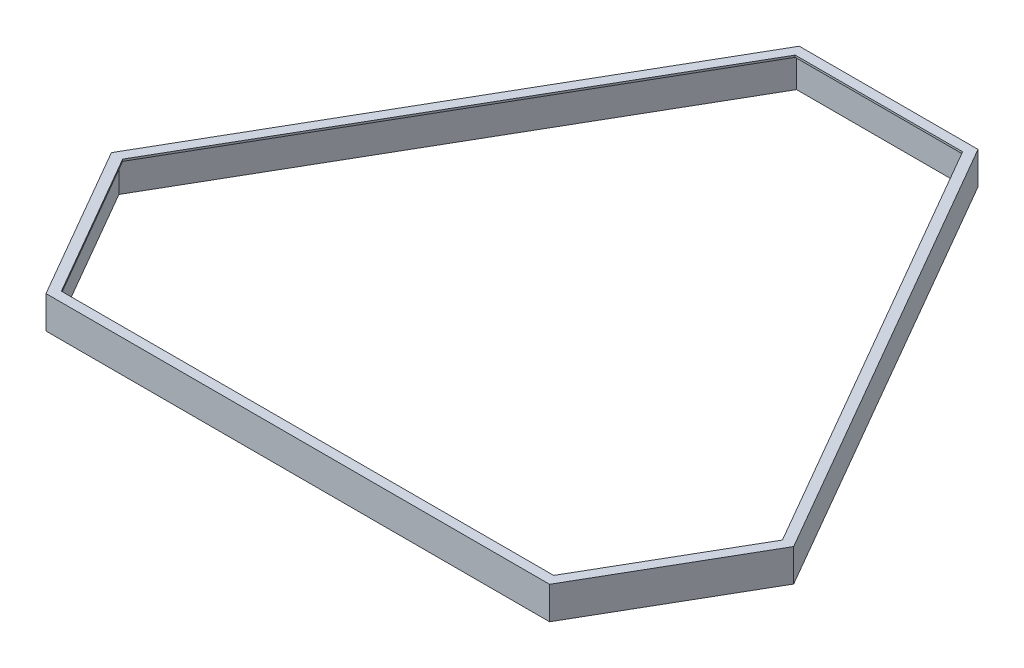
ISO-10303-21;
HEADER;
FILE_DESCRIPTION(('STEP AP214'),'2;1');
FILE_NAME('part.step','',(''),(''),'','','');
FILE_SCHEMA(('AUTOMOTIVE_DESIGN { 1 0 10303 214 1 1 1 1 }'));
ENDSEC;
DATA;
#1=APPLICATION_CONTEXT('core data for automotive mechanical design processes');
#2=APPLICATION_PROTOCOL_DEFINITION('international standard','automotive_design',2000,#1);
#3=PRODUCT_CONTEXT('',#1,'mechanical');
#4=PRODUCT('Part','Part','',(#3));
#5=PRODUCT_RELATED_PRODUCT_CATEGORY('part','',(#4));
#6=PRODUCT_DEFINITION_FORMATION('','',#4);
#7=PRODUCT_DEFINITION_CONTEXT('part definition',#1,'design');
#8=PRODUCT_DEFINITION('design','',#6,#7);
#9=PRODUCT_DEFINITION_SHAPE('','',#8);
#10=(LENGTH_UNIT() NAMED_UNIT(*) SI_UNIT(.MILLI.,.METRE.));
#11=(NAMED_UNIT(*) PLANE_ANGLE_UNIT() SI_UNIT($,.RADIAN.));
#12=(NAMED_UNIT(*) SI_UNIT($,.STERADIAN.) SOLID_ANGLE_UNIT());
#13=UNCERTAINTY_MEASURE_WITH_UNIT(LENGTH_MEASURE(1.E-05),#10,'distance_accuracy_value','');
#14=(GEOMETRIC_REPRESENTATION_CONTEXT(3) GLOBAL_UNCERTAINTY_ASSIGNED_CONTEXT((#13)) GLOBAL_UNIT_ASSIGNED_CONTEXT((#10,
#11,#12)) REPRESENTATION_CONTEXT('',''));
#15=CARTESIAN_POINT('',(0.,0.,0.));
#16=DIRECTION('',(0.,0.,1.));
#17=DIRECTION('',(1.,0.,0.));
#18=AXIS2_PLACEMENT_3D('',#15,#16,#17);
#19=CARTESIAN_POINT('',(-64.5179491924311,10.,-37.2494553338127));
#20=DIRECTION('',(-0.866025403784439,0.,-0.5));
#21=DIRECTION('',(-0.5,0.,0.866025403784439));
#22=AXIS2_PLACEMENT_3D('',#19,#20,#21);
#23=PLANE('',#22);
#24=DIRECTION('',(0.5,0.,-0.866025403784439));
#25=VECTOR('',#24,1.);
#26=CARTESIAN_POINT('',(-64.5179491924311,9.4,-37.2494553338127));
#27=LINE('',#26,#25);
#28=CARTESIAN_POINT('',(-102.690598923242,9.4,28.8675134594814));
#29=VERTEX_POINT('',#28);
#30=CARTESIAN_POINT('',(-26.3452994616208,9.4,-103.366424127107));
#31=VERTEX_POINT('',#30);
#32=EDGE_CURVE('E91',#29,#31,#27,.T.);
#33=ORIENTED_EDGE('',*,*,#32,.F.);
#34=DIRECTION('',(0.,-1.,0.));
#35=VECTOR('',#34,1.);
#36=CARTESIAN_POINT('',(-102.690598923242,10.,28.8675134594814));
#37=LINE('',#36,#35);
#38=CARTESIAN_POINT('',(-102.690598923242,0.,28.8675134594814));
#39=VERTEX_POINT('',#38);
#40=EDGE_CURVE('E320',#29,#39,#37,.T.);
#41=ORIENTED_EDGE('',*,*,#40,.T.);
#42=DIRECTION('',(0.5,0.,-0.866025403784439));
#43=VECTOR('',#42,1.);
#44=CARTESIAN_POINT('',(-64.5179491924311,0.,-37.2494553338127));
#45=LINE('',#44,#43);
#46=CARTESIAN_POINT('',(-26.3452994616208,0.,-103.366424127107));
#47=VERTEX_POINT('',#46);
#48=EDGE_CURVE('E295',#39,#47,#45,.T.);
#49=ORIENTED_EDGE('',*,*,#48,.T.);
#50=DIRECTION('',(0.,-1.,0.));
#51=VECTOR('',#50,1.);
#52=CARTESIAN_POINT('',(-26.3452994616208,10.,-103.366424127107));
#53=LINE('',#52,#51);
#54=EDGE_CURVE('E319',#31,#47,#53,.T.);
#55=ORIENTED_EDGE('',*,*,#54,.F.);
#56=EDGE_LOOP('',(#33,#41,#49,#55));
#57=FACE_BOUND('',#56,.T.);
#58=ADVANCED_FACE('F75',(#57),#23,.F.);
#59=CARTESIAN_POINT('',(-89.5179491924312,10.,51.6832120635534));
#60=DIRECTION('',(-0.866025403784439,0.,0.5));
#61=DIRECTION('',(0.5,0.,0.866025403784439));
#62=AXIS2_PLACEMENT_3D('',#59,#60,#61);
#63=PLANE('',#62);
#64=DIRECTION('',(-0.5,0.,-0.866025403784439));
#65=VECTOR('',#64,1.);
#66=CARTESIAN_POINT('',(-89.5179491924312,9.4,51.6832120635534));
#67=LINE('',#66,#65);
#68=CARTESIAN_POINT('',(-76.3452994616208,9.4,74.4989106676256));
#69=VERTEX_POINT('',#68);
#70=EDGE_CURVE('E98',#69,#29,#67,.T.);
#71=ORIENTED_EDGE('',*,*,#70,.F.);
#72=DIRECTION('',(0.,-1.,0.));
#73=VECTOR('',#72,1.);
#74=CARTESIAN_POINT('',(-76.3452994616208,10.,74.4989106676256));
#75=LINE('',#74,#73);
#76=CARTESIAN_POINT('',(-76.3452994616208,0.,74.4989106676256));
#77=VERTEX_POINT('',#76);
#78=EDGE_CURVE('E324',#69,#77,#75,.T.);
#79=ORIENTED_EDGE('',*,*,#78,.T.);
#80=DIRECTION('',(-0.5,0.,-0.866025403784439));
#81=VECTOR('',#80,1.);
#82=CARTESIAN_POINT('',(-89.5179491924312,0.,51.6832120635534));
#83=LINE('',#82,#81);
#84=EDGE_CURVE('E315',#77,#39,#83,.T.);
#85=ORIENTED_EDGE('',*,*,#84,.T.);
#86=ORIENTED_EDGE('',*,*,#40,.F.);
#87=EDGE_LOOP('',(#71,#79,#85,#86));
#88=FACE_BOUND('',#87,.T.);
#89=ADVANCED_FACE('F437',(#88),#63,.F.);
#90=CARTESIAN_POINT('',(0.,10.,74.4989106676256));
#91=DIRECTION('',(0.,0.,1.));
#92=DIRECTION('',(1.,0.,0.));
#93=AXIS2_PLACEMENT_3D('',#90,#91,#92);
#94=PLANE('',#93);
#95=DIRECTION('',(-1.,0.,0.));
#96=VECTOR('',#95,1.);
#97=CARTESIAN_POINT('',(0.,9.4,74.4989106676256));
#98=LINE('',#97,#96);
#99=CARTESIAN_POINT('',(76.3452994616207,9.4,74.4989106676256));
#100=VERTEX_POINT('',#99);
#101=EDGE_CURVE('E287',#100,#69,#98,.T.);
#102=ORIENTED_EDGE('',*,*,#101,.F.);
#103=DIRECTION('',(0.,-1.,0.));
#104=VECTOR('',#103,1.);
#105=CARTESIAN_POINT('',(76.3452994616207,10.,74.4989106676256));
#106=LINE('',#105,#104);
#107=CARTESIAN_POINT('',(76.3452994616207,0.,74.4989106676256));
#108=VERTEX_POINT('',#107);
#109=EDGE_CURVE('E327',#100,#108,#106,.T.);
#110=ORIENTED_EDGE('',*,*,#109,.T.);
#111=DIRECTION('',(-1.,0.,0.));
#112=VECTOR('',#111,1.);
#113=CARTESIAN_POINT('',(0.,0.,74.4989106676256));
#114=LINE('',#113,#112);
#115=EDGE_CURVE('E311',#108,#77,#114,.T.);
#116=ORIENTED_EDGE('',*,*,#115,.T.);
#117=ORIENTED_EDGE('',*,*,#78,.F.);
#118=EDGE_LOOP('',(#102,#110,#116,#117));
#119=FACE_BOUND('',#118,.T.);
#120=ADVANCED_FACE('F442',(#119),#94,.F.);
#121=CARTESIAN_POINT('',(89.5179491924312,10.,51.6832120635534));
#122=DIRECTION('',(0.866025403784439,0.,0.5));
#123=DIRECTION('',(0.5,0.,-0.866025403784439));
#124=AXIS2_PLACEMENT_3D('',#121,#122,#123);
#125=PLANE('',#124);
#126=DIRECTION('',(-0.5,0.,0.866025403784439));
#127=VECTOR('',#126,1.);
#128=CARTESIAN_POINT('',(89.5179491924312,9.4,51.6832120635534));
#129=LINE('',#128,#127);
#130=CARTESIAN_POINT('',(102.690598923241,9.4,28.8675134594814));
#131=VERTEX_POINT('',#130);
#132=EDGE_CURVE('E283',#131,#100,#129,.T.);
#133=ORIENTED_EDGE('',*,*,#132,.F.);
#134=DIRECTION('',(0.,-1.,0.));
#135=VECTOR('',#134,1.);
#136=CARTESIAN_POINT('',(102.690598923241,10.,28.8675134594814));
#137=LINE('',#136,#135);
#138=CARTESIAN_POINT('',(102.690598923241,0.,28.8675134594814));
#139=VERTEX_POINT('',#138);
#140=EDGE_CURVE('E330',#131,#139,#137,.T.);
#141=ORIENTED_EDGE('',*,*,#140,.T.);
#142=DIRECTION('',(-0.5,0.,0.866025403784439));
#143=VECTOR('',#142,1.);
#144=CARTESIAN_POINT('',(89.5179491924312,0.,51.6832120635534));
#145=LINE('',#144,#143);
#146=EDGE_CURVE('E307',#139,#108,#145,.T.);
#147=ORIENTED_EDGE('',*,*,#146,.T.);
#148=ORIENTED_EDGE('',*,*,#109,.F.);
#149=EDGE_LOOP('',(#133,#141,#147,#148));
#150=FACE_BOUND('',#149,.T.);
#151=ADVANCED_FACE('F465',(#150),#125,.F.);
#152=CARTESIAN_POINT('',(64.5179491924311,10.,-37.2494553338127));
#153=DIRECTION('',(0.866025403784439,0.,-0.5));
#154=DIRECTION('',(-0.5,0.,-0.866025403784439));
#155=AXIS2_PLACEMENT_3D('',#152,#153,#154);
#156=PLANE('',#155);
#157=DIRECTION('',(0.5,0.,0.866025403784439));
#158=VECTOR('',#157,1.);
#159=CARTESIAN_POINT('',(64.5179491924311,9.4,-37.2494553338127));
#160=LINE('',#159,#158);
#161=CARTESIAN_POINT('',(26.3452994616207,9.4,-103.366424127107));
#162=VERTEX_POINT('',#161);
#163=EDGE_CURVE('E268',#162,#131,#160,.T.);
#164=ORIENTED_EDGE('',*,*,#163,.F.);
#165=DIRECTION('',(0.,-1.,0.));
#166=VECTOR('',#165,1.);
#167=CARTESIAN_POINT('',(26.3452994616207,10.,-103.366424127107));
#168=LINE('',#167,#166);
#169=CARTESIAN_POINT('',(26.3452994616207,0.,-103.366424127107));
#170=VERTEX_POINT('',#169);
#171=EDGE_CURVE('E333',#162,#170,#168,.T.);
#172=ORIENTED_EDGE('',*,*,#171,.T.);
#173=DIRECTION('',(0.5,0.,0.866025403784439));
#174=VECTOR('',#173,1.);
#175=CARTESIAN_POINT('',(64.5179491924311,0.,-37.2494553338127));
#176=LINE('',#175,#174);
#177=EDGE_CURVE('E303',#170,#139,#176,.T.);
#178=ORIENTED_EDGE('',*,*,#177,.T.);
#179=ORIENTED_EDGE('',*,*,#140,.F.);
#180=EDGE_LOOP('',(#164,#172,#178,#179));
#181=FACE_BOUND('',#180,.T.);
#182=ADVANCED_FACE('F469',(#181),#156,.F.);
#183=CARTESIAN_POINT('',(0.,10.,-103.366424127107));
#184=DIRECTION('',(0.,0.,-1.));
#185=DIRECTION('',(-1.,0.,0.));
#186=AXIS2_PLACEMENT_3D('',#183,#184,#185);
#187=PLANE('',#186);
#188=DIRECTION('',(1.,0.,0.));
#189=VECTOR('',#188,1.);
#190=CARTESIAN_POINT('',(0.,9.4,-103.366424127107));
#191=LINE('',#190,#189);
#192=EDGE_CURVE('E12',#31,#162,#191,.T.);
#193=ORIENTED_EDGE('',*,*,#192,.F.);
#194=ORIENTED_EDGE('',*,*,#54,.T.);
#195=DIRECTION('',(1.,0.,0.));
#196=VECTOR('',#195,1.);
#197=CARTESIAN_POINT('',(0.,0.,-103.366424127107));
#198=LINE('',#197,#196);
#199=EDGE_CURVE('E299',#47,#170,#198,.T.);
#200=ORIENTED_EDGE('',*,*,#199,.T.);
#201=ORIENTED_EDGE('',*,*,#171,.F.);
#202=EDGE_LOOP('',(#193,#194,#200,#201));
#203=FACE_BOUND('',#202,.T.);
#204=ADVANCED_FACE('F446',(#203),#187,.F.);
#205=CARTESIAN_POINT('',(-105.,10.,28.8675134594814));
#206=DIRECTION('',(-0.866025403784439,0.,-0.5));
#207=DIRECTION('',(-0.5,0.,0.866025403784439));
#208=AXIS2_PLACEMENT_3D('',#205,#206,#207);
#209=PLANE('',#208);
#210=DIRECTION('',(0.,-1.,0.));
#211=VECTOR('',#210,1.);
#212=CARTESIAN_POINT('',(-27.5,10.,-105.366424127107));
#213=LINE('',#212,#211);
#214=CARTESIAN_POINT('',(-27.5,10.,-105.366424127107));
#215=VERTEX_POINT('',#214);
#216=CARTESIAN_POINT('',(-27.5,0.,-105.366424127107));
#217=VERTEX_POINT('',#216);
#218=EDGE_CURVE('E363',#215,#217,#213,.T.);
#219=ORIENTED_EDGE('',*,*,#218,.T.);
#220=DIRECTION('',(0.5,0.,-0.866025403784439));
#221=VECTOR('',#220,1.);
#222=CARTESIAN_POINT('',(-105.,0.,28.8675134594814));
#223=LINE('',#222,#221);
#224=CARTESIAN_POINT('',(-105.,0.,28.8675134594814));
#225=VERTEX_POINT('',#224);
#226=EDGE_CURVE('E323',#225,#217,#223,.T.);
#227=ORIENTED_EDGE('',*,*,#226,.F.);
#228=DIRECTION('',(0.,-1.,0.));
#229=VECTOR('',#228,1.);
#230=CARTESIAN_POINT('',(-105.,10.,28.8675134594814));
#231=LINE('',#230,#229);
#232=CARTESIAN_POINT('',(-105.,10.,28.8675134594814));
#233=VERTEX_POINT('',#232);
#234=EDGE_CURVE('E84',#233,#225,#231,.T.);
#235=ORIENTED_EDGE('',*,*,#234,.F.);
#236=DIRECTION('',(0.5,0.,-0.866025403784439));
#237=VECTOR('',#236,1.);
#238=CARTESIAN_POINT('',(-105.,10.,28.8675134594814));
#239=LINE('',#238,#237);
#240=EDGE_CURVE('E338',#233,#215,#239,.T.);
#241=ORIENTED_EDGE('',*,*,#240,.T.);
#242=EDGE_LOOP('',(#219,#227,#235,#241));
#243=FACE_BOUND('',#242,.T.);
#244=ADVANCED_FACE('F77',(#243),#209,.T.);
#245=CARTESIAN_POINT('',(-77.5,10.,76.4989106676256));
#246=DIRECTION('',(-0.866025403784439,0.,0.5));
#247=DIRECTION('',(0.5,0.,0.866025403784439));
#248=AXIS2_PLACEMENT_3D('',#245,#246,#247);
#249=PLANE('',#248);
#250=ORIENTED_EDGE('',*,*,#234,.T.);
#251=DIRECTION('',(-0.5,0.,-0.866025403784438));
#252=VECTOR('',#251,1.);
#253=CARTESIAN_POINT('',(-77.5,0.,76.4989106676256));
#254=LINE('',#253,#252);
#255=CARTESIAN_POINT('',(-77.5,0.,76.4989106676256));
#256=VERTEX_POINT('',#255);
#257=EDGE_CURVE('E343',#256,#225,#254,.T.);
#258=ORIENTED_EDGE('',*,*,#257,.F.);
#259=DIRECTION('',(0.,-1.,0.));
#260=VECTOR('',#259,1.);
#261=CARTESIAN_POINT('',(-77.5,10.,76.4989106676256));
#262=LINE('',#261,#260);
#263=CARTESIAN_POINT('',(-77.5,10.,76.4989106676256));
#264=VERTEX_POINT('',#263);
#265=EDGE_CURVE('E388',#264,#256,#262,.T.);
#266=ORIENTED_EDGE('',*,*,#265,.F.);
#267=DIRECTION('',(-0.5,0.,-0.866025403784438));
#268=VECTOR('',#267,1.);
#269=CARTESIAN_POINT('',(-77.5,10.,76.4989106676256));
#270=LINE('',#269,#268);
#271=EDGE_CURVE('E359',#264,#233,#270,.T.);
#272=ORIENTED_EDGE('',*,*,#271,.T.);
#273=EDGE_LOOP('',(#250,#258,#266,#272));
#274=FACE_BOUND('',#273,.T.);
#275=ADVANCED_FACE('F413',(#274),#249,.T.);
#276=CARTESIAN_POINT('',(77.5,10.,76.4989106676256));
#277=DIRECTION('',(0.,0.,1.));
#278=DIRECTION('',(1.,0.,0.));
#279=AXIS2_PLACEMENT_3D('',#276,#277,#278);
#280=PLANE('',#279);
#281=ORIENTED_EDGE('',*,*,#265,.T.);
#282=DIRECTION('',(-1.,0.,0.));
#283=VECTOR('',#282,1.);
#284=CARTESIAN_POINT('',(77.5,0.,76.4989106676256));
#285=LINE('',#284,#283);
#286=CARTESIAN_POINT('',(77.5,0.,76.4989106676256));
#287=VERTEX_POINT('',#286);
#288=EDGE_CURVE('E379',#287,#256,#285,.T.);
#289=ORIENTED_EDGE('',*,*,#288,.F.);
#290=DIRECTION('',(0.,-1.,0.));
#291=VECTOR('',#290,1.);
#292=CARTESIAN_POINT('',(77.5,10.,76.4989106676256));
#293=LINE('',#292,#291);
#294=CARTESIAN_POINT('',(77.5,10.,76.4989106676256));
#295=VERTEX_POINT('',#294);
#296=EDGE_CURVE('E391',#295,#287,#293,.T.);
#297=ORIENTED_EDGE('',*,*,#296,.F.);
#298=DIRECTION('',(-1.,0.,0.));
#299=VECTOR('',#298,1.);
#300=CARTESIAN_POINT('',(77.5,10.,76.4989106676256));
#301=LINE('',#300,#299);
#302=EDGE_CURVE('E355',#295,#264,#301,.T.);
#303=ORIENTED_EDGE('',*,*,#302,.T.);
#304=EDGE_LOOP('',(#281,#289,#297,#303));
#305=FACE_BOUND('',#304,.T.);
#306=ADVANCED_FACE('F427',(#305),#280,.T.);
#307=CARTESIAN_POINT('',(105.,10.,28.8675134594814));
#308=DIRECTION('',(0.866025403784439,0.,0.5));
#309=DIRECTION('',(0.5,0.,-0.866025403784439));
#310=AXIS2_PLACEMENT_3D('',#307,#308,#309);
#311=PLANE('',#310);
#312=ORIENTED_EDGE('',*,*,#296,.T.);
#313=DIRECTION('',(-0.5,0.,0.866025403784439));
#314=VECTOR('',#313,1.);
#315=CARTESIAN_POINT('',(105.,0.,28.8675134594814));
#316=LINE('',#315,#314);
#317=CARTESIAN_POINT('',(105.,0.,28.8675134594814));
#318=VERTEX_POINT('',#317);
#319=EDGE_CURVE('E375',#318,#287,#316,.T.);
#320=ORIENTED_EDGE('',*,*,#319,.F.);
#321=DIRECTION('',(0.,-1.,0.));
#322=VECTOR('',#321,1.);
#323=CARTESIAN_POINT('',(105.,10.,28.8675134594814));
#324=LINE('',#323,#322);
#325=CARTESIAN_POINT('',(105.,10.,28.8675134594814));
#326=VERTEX_POINT('',#325);
#327=EDGE_CURVE('E394',#326,#318,#324,.T.);
#328=ORIENTED_EDGE('',*,*,#327,.F.);
#329=DIRECTION('',(-0.5,0.,0.866025403784439));
#330=VECTOR('',#329,1.);
#331=CARTESIAN_POINT('',(105.,10.,28.8675134594814));
#332=LINE('',#331,#330);
#333=EDGE_CURVE('E351',#326,#295,#332,.T.);
#334=ORIENTED_EDGE('',*,*,#333,.T.);
#335=EDGE_LOOP('',(#312,#320,#328,#334));
#336=FACE_BOUND('',#335,.T.);
#337=ADVANCED_FACE('F425',(#336),#311,.T.);
#338=CARTESIAN_POINT('',(27.5,10.,-105.366424127107));
#339=DIRECTION('',(0.866025403784439,0.,-0.5));
#340=DIRECTION('',(-0.5,0.,-0.866025403784439));
#341=AXIS2_PLACEMENT_3D('',#338,#339,#340);
#342=PLANE('',#341);
#343=ORIENTED_EDGE('',*,*,#327,.T.);
#344=DIRECTION('',(0.5,0.,0.866025403784439));
#345=VECTOR('',#344,1.);
#346=CARTESIAN_POINT('',(27.5,0.,-105.366424127107));
#347=LINE('',#346,#345);
#348=CARTESIAN_POINT('',(27.5,0.,-105.366424127107));
#349=VERTEX_POINT('',#348);
#350=EDGE_CURVE('E371',#349,#318,#347,.T.);
#351=ORIENTED_EDGE('',*,*,#350,.F.);
#352=DIRECTION('',(0.,-1.,0.));
#353=VECTOR('',#352,1.);
#354=CARTESIAN_POINT('',(27.5,10.,-105.366424127107));
#355=LINE('',#354,#353);
#356=CARTESIAN_POINT('',(27.5,10.,-105.366424127107));
#357=VERTEX_POINT('',#356);
#358=EDGE_CURVE('E397',#357,#349,#355,.T.);
#359=ORIENTED_EDGE('',*,*,#358,.F.);
#360=DIRECTION('',(0.5,0.,0.866025403784439));
#361=VECTOR('',#360,1.);
#362=CARTESIAN_POINT('',(27.5,10.,-105.366424127107));
#363=LINE('',#362,#361);
#364=EDGE_CURVE('E347',#357,#326,#363,.T.);
#365=ORIENTED_EDGE('',*,*,#364,.T.);
#366=EDGE_LOOP('',(#343,#351,#359,#365));
#367=FACE_BOUND('',#366,.T.);
#368=ADVANCED_FACE('F422',(#367),#342,.T.);
#369=CARTESIAN_POINT('',(-27.5,10.,-105.366424127107));
#370=DIRECTION('',(0.,0.,-1.));
#371=DIRECTION('',(-1.,0.,0.));
#372=AXIS2_PLACEMENT_3D('',#369,#370,#371);
#373=PLANE('',#372);
#374=ORIENTED_EDGE('',*,*,#358,.T.);
#375=DIRECTION('',(1.,0.,0.));
#376=VECTOR('',#375,1.);
#377=CARTESIAN_POINT('',(-27.5,0.,-105.366424127107));
#378=LINE('',#377,#376);
#379=EDGE_CURVE('E367',#217,#349,#378,.T.);
#380=ORIENTED_EDGE('',*,*,#379,.F.);
#381=ORIENTED_EDGE('',*,*,#218,.F.);
#382=DIRECTION('',(1.,0.,0.));
#383=VECTOR('',#382,1.);
#384=CARTESIAN_POINT('',(-27.5,10.,-105.366424127107));
#385=LINE('',#384,#383);
#386=EDGE_CURVE('E342',#215,#357,#385,.T.);
#387=ORIENTED_EDGE('',*,*,#386,.T.);
#388=EDGE_LOOP('',(#374,#380,#381,#387));
#389=FACE_BOUND('',#388,.T.);
#390=ADVANCED_FACE('F406',(#389),#373,.T.);
#391=CARTESIAN_POINT('',(0.,10.,0.));
#392=DIRECTION('',(0.,-1.,0.));
#393=DIRECTION('',(0.,0.,-1.));
#394=AXIS2_PLACEMENT_3D('',#391,#392,#393);
#395=PLANE('',#394);
#396=ORIENTED_EDGE('',*,*,#240,.F.);
#397=ORIENTED_EDGE('',*,*,#271,.F.);
#398=ORIENTED_EDGE('',*,*,#302,.F.);
#399=ORIENTED_EDGE('',*,*,#333,.F.);
#400=ORIENTED_EDGE('',*,*,#364,.F.);
#401=ORIENTED_EDGE('',*,*,#386,.F.);
#402=EDGE_LOOP('',(#396,#397,#398,#399,#400,#401));
#403=FACE_BOUND('',#402,.T.);
#404=DIRECTION('',(-1.,0.,0.));
#405=VECTOR('',#404,1.);
#406=CARTESIAN_POINT('',(25.7679491924311,10.,-102.366424127107));
#407=LINE('',#406,#405);
#408=CARTESIAN_POINT('',(25.7679491924311,10.,-102.366424127107));
#409=VERTEX_POINT('',#408);
#410=CARTESIAN_POINT('',(-25.7679491924311,10.,-102.366424127107));
#411=VERTEX_POINT('',#410);
#412=EDGE_CURVE('E209',#409,#411,#407,.T.);
#413=ORIENTED_EDGE('',*,*,#412,.F.);
#414=DIRECTION('',(-0.5,0.,-0.866025403784439));
#415=VECTOR('',#414,1.);
#416=CARTESIAN_POINT('',(101.535898384862,10.,28.8675134594814));
#417=LINE('',#416,#415);
#418=CARTESIAN_POINT('',(101.535898384862,10.,28.8675134594814));
#419=VERTEX_POINT('',#418);
#420=EDGE_CURVE('E231',#419,#409,#417,.T.);
#421=ORIENTED_EDGE('',*,*,#420,.F.);
#422=DIRECTION('',(0.5,0.,-0.866025403784439));
#423=VECTOR('',#422,1.);
#424=CARTESIAN_POINT('',(75.7679491924311,10.,73.4989106676256));
#425=LINE('',#424,#423);
#426=CARTESIAN_POINT('',(75.7679491924311,10.,73.4989106676256));
#427=VERTEX_POINT('',#426);
#428=EDGE_CURVE('E235',#427,#419,#425,.T.);
#429=ORIENTED_EDGE('',*,*,#428,.F.);
#430=DIRECTION('',(1.,0.,0.));
#431=VECTOR('',#430,1.);
#432=CARTESIAN_POINT('',(-75.7679491924311,10.,73.4989106676256));
#433=LINE('',#432,#431);
#434=CARTESIAN_POINT('',(-75.7679491924311,10.,73.4989106676256));
#435=VERTEX_POINT('',#434);
#436=EDGE_CURVE('E258',#435,#427,#433,.T.);
#437=ORIENTED_EDGE('',*,*,#436,.F.);
#438=DIRECTION('',(0.5,0.,0.866025403784439));
#439=VECTOR('',#438,1.);
#440=CARTESIAN_POINT('',(-101.535898384862,10.,28.8675134594814));
#441=LINE('',#440,#439);
#442=CARTESIAN_POINT('',(-101.535898384862,10.,28.8675134594814));
#443=VERTEX_POINT('',#442);
#444=EDGE_CURVE('E254',#443,#435,#441,.T.);
#445=ORIENTED_EDGE('',*,*,#444,.F.);
#446=DIRECTION('',(-0.5,0.,0.866025403784439));
#447=VECTOR('',#446,1.);
#448=CARTESIAN_POINT('',(-25.7679491924311,10.,-102.366424127107));
#449=LINE('',#448,#447);
#450=EDGE_CURVE('E251',#411,#443,#449,.T.);
#451=ORIENTED_EDGE('',*,*,#450,.F.);
#452=EDGE_LOOP('',(#413,#421,#429,#437,#445,#451));
#453=FACE_BOUND('',#452,.T.);
#454=ADVANCED_FACE('F416',(#403,#453),#395,.F.);
#455=CARTESIAN_POINT('',(0.,0.,0.));
#456=DIRECTION('',(0.,-1.,0.));
#457=DIRECTION('',(0.,0.,-1.));
#458=AXIS2_PLACEMENT_3D('',#455,#456,#457);
#459=PLANE('',#458);
#460=ORIENTED_EDGE('',*,*,#48,.F.);
#461=ORIENTED_EDGE('',*,*,#84,.F.);
#462=ORIENTED_EDGE('',*,*,#115,.F.);
#463=ORIENTED_EDGE('',*,*,#146,.F.);
#464=ORIENTED_EDGE('',*,*,#177,.F.);
#465=ORIENTED_EDGE('',*,*,#199,.F.);
#466=EDGE_LOOP('',(#460,#461,#462,#463,#464,#465));
#467=FACE_BOUND('',#466,.T.);
#468=ORIENTED_EDGE('',*,*,#226,.T.);
#469=ORIENTED_EDGE('',*,*,#379,.T.);
#470=ORIENTED_EDGE('',*,*,#350,.T.);
#471=ORIENTED_EDGE('',*,*,#319,.T.);
#472=ORIENTED_EDGE('',*,*,#288,.T.);
#473=ORIENTED_EDGE('',*,*,#257,.T.);
#474=EDGE_LOOP('',(#468,#469,#470,#471,#472,#473));
#475=FACE_BOUND('',#474,.T.);
#476=ADVANCED_FACE('F409',(#467,#475),#459,.T.);
#477=CARTESIAN_POINT('',(0.,9.4,0.));
#478=DIRECTION('',(0.,1.,0.));
#479=DIRECTION('',(0.,0.,1.));
#480=AXIS2_PLACEMENT_3D('',#477,#478,#479);
#481=PLANE('',#480);
#482=DIRECTION('',(-0.5,0.,-0.866025403784439));
#483=VECTOR('',#482,1.);
#484=CARTESIAN_POINT('',(101.535898384862,9.4,28.8675134594814));
#485=LINE('',#484,#483);
#486=CARTESIAN_POINT('',(101.535898384862,9.4,28.8675134594814));
#487=VERTEX_POINT('',#486);
#488=CARTESIAN_POINT('',(25.7679491924311,9.4,-102.366424127107));
#489=VERTEX_POINT('',#488);
#490=EDGE_CURVE('E215',#487,#489,#485,.T.);
#491=ORIENTED_EDGE('',*,*,#490,.T.);
#492=DIRECTION('',(-1.,0.,0.));
#493=VECTOR('',#492,1.);
#494=CARTESIAN_POINT('',(25.7679491924311,9.4,-102.366424127107));
#495=LINE('',#494,#493);
#496=CARTESIAN_POINT('',(-25.7679491924311,9.4,-102.366424127107));
#497=VERTEX_POINT('',#496);
#498=EDGE_CURVE('E206',#489,#497,#495,.T.);
#499=ORIENTED_EDGE('',*,*,#498,.T.);
#500=DIRECTION('',(-0.5,0.,0.866025403784439));
#501=VECTOR('',#500,1.);
#502=CARTESIAN_POINT('',(-25.7679491924311,9.4,-102.366424127107));
#503=LINE('',#502,#501);
#504=CARTESIAN_POINT('',(-101.535898384862,9.4,28.8675134594814));
#505=VERTEX_POINT('',#504);
#506=EDGE_CURVE('E219',#497,#505,#503,.T.);
#507=ORIENTED_EDGE('',*,*,#506,.T.);
#508=DIRECTION('',(0.5,0.,0.866025403784439));
#509=VECTOR('',#508,1.);
#510=CARTESIAN_POINT('',(-101.535898384862,9.4,28.8675134594814));
#511=LINE('',#510,#509);
#512=CARTESIAN_POINT('',(-75.7679491924311,9.4,73.4989106676256));
#513=VERTEX_POINT('',#512);
#514=EDGE_CURVE('E224',#505,#513,#511,.T.);
#515=ORIENTED_EDGE('',*,*,#514,.T.);
#516=DIRECTION('',(1.,0.,0.));
#517=VECTOR('',#516,1.);
#518=CARTESIAN_POINT('',(-75.7679491924311,9.4,73.4989106676256));
#519=LINE('',#518,#517);
#520=CARTESIAN_POINT('',(75.7679491924311,9.4,73.4989106676256));
#521=VERTEX_POINT('',#520);
#522=EDGE_CURVE('E240',#513,#521,#519,.T.);
#523=ORIENTED_EDGE('',*,*,#522,.T.);
#524=DIRECTION('',(0.5,0.,-0.866025403784439));
#525=VECTOR('',#524,1.);
#526=CARTESIAN_POINT('',(75.7679491924311,9.4,73.4989106676256));
#527=LINE('',#526,#525);
#528=EDGE_CURVE('E244',#521,#487,#527,.T.);
#529=ORIENTED_EDGE('',*,*,#528,.T.);
#530=EDGE_LOOP('',(#491,#499,#507,#515,#523,#529));
#531=FACE_BOUND('',#530,.T.);
#532=ORIENTED_EDGE('',*,*,#70,.T.);
#533=ORIENTED_EDGE('',*,*,#32,.T.);
#534=ORIENTED_EDGE('',*,*,#192,.T.);
#535=ORIENTED_EDGE('',*,*,#163,.T.);
#536=ORIENTED_EDGE('',*,*,#132,.T.);
#537=ORIENTED_EDGE('',*,*,#101,.T.);
#538=EDGE_LOOP('',(#532,#533,#534,#535,#536,#537));
#539=FACE_BOUND('',#538,.T.);
#540=ADVANCED_FACE('F226',(#531,#539),#481,.F.);
#541=CARTESIAN_POINT('',(25.7679491924311,9.4,-102.366424127107));
#542=DIRECTION('',(0.,0.,-1.));
#543=DIRECTION('',(-1.,0.,0.));
#544=AXIS2_PLACEMENT_3D('',#541,#542,#543);
#545=PLANE('',#544);
#546=ORIENTED_EDGE('',*,*,#412,.T.);
#547=DIRECTION('',(0.,1.,0.));
#548=VECTOR('',#547,1.);
#549=CARTESIAN_POINT('',(-25.7679491924311,9.4,-102.366424127107));
#550=LINE('',#549,#548);
#551=EDGE_CURVE('E202',#497,#411,#550,.T.);
#552=ORIENTED_EDGE('',*,*,#551,.F.);
#553=ORIENTED_EDGE('',*,*,#498,.F.);
#554=DIRECTION('',(0.,1.,0.));
#555=VECTOR('',#554,1.);
#556=CARTESIAN_POINT('',(25.7679491924311,9.4,-102.366424127107));
#557=LINE('',#556,#555);
#558=EDGE_CURVE('E265',#489,#409,#557,.T.);
#559=ORIENTED_EDGE('',*,*,#558,.T.);
#560=EDGE_LOOP('',(#546,#552,#553,#559));
#561=FACE_BOUND('',#560,.T.);
#562=ADVANCED_FACE('F204',(#561),#545,.F.);
#563=CARTESIAN_POINT('',(101.535898384862,9.4,28.8675134594814));
#564=DIRECTION('',(0.866025403784439,0.,-0.5));
#565=DIRECTION('',(-0.5,0.,-0.866025403784439));
#566=AXIS2_PLACEMENT_3D('',#563,#564,#565);
#567=PLANE('',#566);
#568=ORIENTED_EDGE('',*,*,#420,.T.);
#569=ORIENTED_EDGE('',*,*,#558,.F.);
#570=ORIENTED_EDGE('',*,*,#490,.F.);
#571=DIRECTION('',(0.,1.,0.));
#572=VECTOR('',#571,1.);
#573=CARTESIAN_POINT('',(101.535898384862,9.4,28.8675134594814));
#574=LINE('',#573,#572);
#575=EDGE_CURVE('E269',#487,#419,#574,.T.);
#576=ORIENTED_EDGE('',*,*,#575,.T.);
#577=EDGE_LOOP('',(#568,#569,#570,#576));
#578=FACE_BOUND('',#577,.T.);
#579=ADVANCED_FACE('F485',(#578),#567,.F.);
#580=CARTESIAN_POINT('',(75.7679491924311,9.4,73.4989106676256));
#581=DIRECTION('',(0.866025403784439,0.,0.5));
#582=DIRECTION('',(0.5,0.,-0.866025403784439));
#583=AXIS2_PLACEMENT_3D('',#580,#581,#582);
#584=PLANE('',#583);
#585=ORIENTED_EDGE('',*,*,#428,.T.);
#586=ORIENTED_EDGE('',*,*,#575,.F.);
#587=ORIENTED_EDGE('',*,*,#528,.F.);
#588=DIRECTION('',(0.,1.,0.));
#589=VECTOR('',#588,1.);
#590=CARTESIAN_POINT('',(75.7679491924311,9.4,73.4989106676256));
#591=LINE('',#590,#589);
#592=EDGE_CURVE('E272',#521,#427,#591,.T.);
#593=ORIENTED_EDGE('',*,*,#592,.T.);
#594=EDGE_LOOP('',(#585,#586,#587,#593));
#595=FACE_BOUND('',#594,.T.);
#596=ADVANCED_FACE('F495',(#595),#584,.F.);
#597=CARTESIAN_POINT('',(-75.7679491924311,9.4,73.4989106676256));
#598=DIRECTION('',(0.,0.,1.));
#599=DIRECTION('',(1.,0.,0.));
#600=AXIS2_PLACEMENT_3D('',#597,#598,#599);
#601=PLANE('',#600);
#602=ORIENTED_EDGE('',*,*,#436,.T.);
#603=ORIENTED_EDGE('',*,*,#592,.F.);
#604=ORIENTED_EDGE('',*,*,#522,.F.);
#605=DIRECTION('',(0.,1.,0.));
#606=VECTOR('',#605,1.);
#607=CARTESIAN_POINT('',(-75.7679491924311,9.4,73.4989106676256));
#608=LINE('',#607,#606);
#609=EDGE_CURVE('E275',#513,#435,#608,.T.);
#610=ORIENTED_EDGE('',*,*,#609,.T.);
#611=EDGE_LOOP('',(#602,#603,#604,#610));
#612=FACE_BOUND('',#611,.T.);
#613=ADVANCED_FACE('F491',(#612),#601,.F.);
#614=CARTESIAN_POINT('',(-101.535898384862,9.4,28.8675134594814));
#615=DIRECTION('',(-0.866025403784439,0.,0.5));
#616=DIRECTION('',(0.5,0.,0.866025403784439));
#617=AXIS2_PLACEMENT_3D('',#614,#615,#616);
#618=PLANE('',#617);
#619=ORIENTED_EDGE('',*,*,#444,.T.);
#620=ORIENTED_EDGE('',*,*,#609,.F.);
#621=ORIENTED_EDGE('',*,*,#514,.F.);
#622=DIRECTION('',(0.,1.,0.));
#623=VECTOR('',#622,1.);
#624=CARTESIAN_POINT('',(-101.535898384862,9.4,28.8675134594814));
#625=LINE('',#624,#623);
#626=EDGE_CURVE('E214',#505,#443,#625,.T.);
#627=ORIENTED_EDGE('',*,*,#626,.T.);
#628=EDGE_LOOP('',(#619,#620,#621,#627));
#629=FACE_BOUND('',#628,.T.);
#630=ADVANCED_FACE('F488',(#629),#618,.F.);
#631=CARTESIAN_POINT('',(-25.7679491924311,9.4,-102.366424127107));
#632=DIRECTION('',(-0.866025403784439,0.,-0.5));
#633=DIRECTION('',(-0.5,0.,0.866025403784439));
#634=AXIS2_PLACEMENT_3D('',#631,#632,#633);
#635=PLANE('',#634);
#636=ORIENTED_EDGE('',*,*,#450,.T.);
#637=ORIENTED_EDGE('',*,*,#626,.F.);
#638=ORIENTED_EDGE('',*,*,#506,.F.);
#639=ORIENTED_EDGE('',*,*,#551,.T.);
#640=EDGE_LOOP('',(#636,#637,#638,#639));
#641=FACE_BOUND('',#640,.T.);
#642=ADVANCED_FACE('F220',(#641),#635,.F.);
#643=CLOSED_SHELL('',(#58,#89,#120,#151,#182,#204,#244,#275,#306,#337,#368,#390,#454,#476,#540,
#562,#579,#596,#613,#630,#642));
#644=MANIFOLD_SOLID_BREP('B2',#643);
#645=ADVANCED_BREP_SHAPE_REPRESENTATION('',(#18,#644),#14);
#646=SHAPE_DEFINITION_REPRESENTATION(#9,#645);
ENDSEC;
END-ISO-10303-21;
